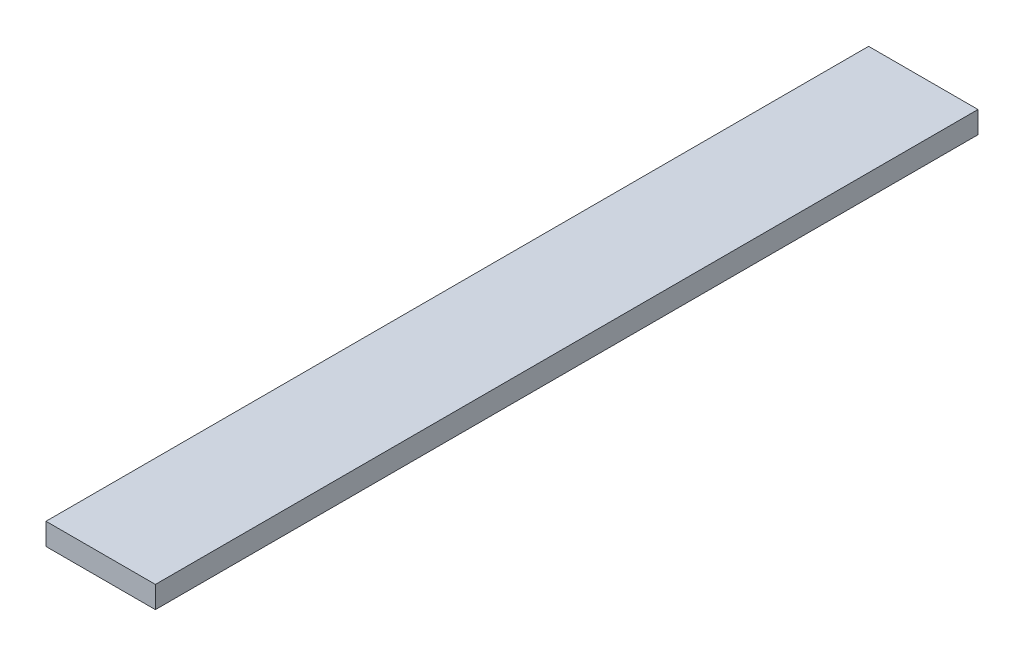
ISO-10303-21;
HEADER;
FILE_DESCRIPTION(('STEP AP214'),'2;1');
FILE_NAME('part.step','',(''),(''),'','','');
FILE_SCHEMA(('AUTOMOTIVE_DESIGN { 1 0 10303 214 1 1 1 1 }'));
ENDSEC;
DATA;
#1=APPLICATION_CONTEXT('core data for automotive mechanical design processes');
#2=APPLICATION_PROTOCOL_DEFINITION('international standard','automotive_design',2000,#1);
#3=PRODUCT_CONTEXT('',#1,'mechanical');
#4=PRODUCT('Part','Part','',(#3));
#5=PRODUCT_RELATED_PRODUCT_CATEGORY('part','',(#4));
#6=PRODUCT_DEFINITION_FORMATION('','',#4);
#7=PRODUCT_DEFINITION_CONTEXT('part definition',#1,'design');
#8=PRODUCT_DEFINITION('design','',#6,#7);
#9=PRODUCT_DEFINITION_SHAPE('','',#8);
#10=(LENGTH_UNIT() NAMED_UNIT(*) SI_UNIT(.MILLI.,.METRE.));
#11=(NAMED_UNIT(*) PLANE_ANGLE_UNIT() SI_UNIT($,.RADIAN.));
#12=(NAMED_UNIT(*) SI_UNIT($,.STERADIAN.) SOLID_ANGLE_UNIT());
#13=UNCERTAINTY_MEASURE_WITH_UNIT(LENGTH_MEASURE(1.E-05),#10,'distance_accuracy_value','');
#14=(GEOMETRIC_REPRESENTATION_CONTEXT(3) GLOBAL_UNCERTAINTY_ASSIGNED_CONTEXT((#13)) GLOBAL_UNIT_ASSIGNED_CONTEXT((#10,
#11,#12)) REPRESENTATION_CONTEXT('',''));
#15=CARTESIAN_POINT('',(0.,0.,0.));
#16=DIRECTION('',(0.,0.,1.));
#17=DIRECTION('',(1.,0.,0.));
#18=AXIS2_PLACEMENT_3D('',#15,#16,#17);
#19=CARTESIAN_POINT('',(0.,1.42999999999,0.));
#20=DIRECTION('',(0.,-1.,0.));
#21=DIRECTION('',(1.,0.,0.));
#22=AXIS2_PLACEMENT_3D('',#19,#20,#21);
#23=PLANE('',#22);
#24=DIRECTION('',(0.,0.,1.));
#25=VECTOR('',#24,1.);
#26=CARTESIAN_POINT('',(0.125,1.42999999999,0.195));
#27=LINE('',#26,#25);
#28=CARTESIAN_POINT('',(0.125,1.42999999999,0.195));
#29=VERTEX_POINT('',#28);
#30=CARTESIAN_POINT('',(0.125,1.42999999999,2.075));
#31=VERTEX_POINT('',#30);
#32=EDGE_CURVE('E80',#29,#31,#27,.T.);
#33=ORIENTED_EDGE('',*,*,#32,.T.);
#34=DIRECTION('',(-1.,0.,0.));
#35=VECTOR('',#34,1.);
#36=CARTESIAN_POINT('',(0.375,1.42999999999,2.075));
#37=LINE('',#36,#35);
#38=CARTESIAN_POINT('',(0.375,1.42999999999,2.075));
#39=VERTEX_POINT('',#38);
#40=EDGE_CURVE('E67',#31,#39,#37,.F.);
#41=ORIENTED_EDGE('',*,*,#40,.T.);
#42=DIRECTION('',(0.,0.,1.));
#43=VECTOR('',#42,1.);
#44=CARTESIAN_POINT('',(0.375,1.42999999999,0.195));
#45=LINE('',#44,#43);
#46=CARTESIAN_POINT('',(0.375,1.42999999999,0.195));
#47=VERTEX_POINT('',#46);
#48=EDGE_CURVE('E54',#39,#47,#45,.F.);
#49=ORIENTED_EDGE('',*,*,#48,.T.);
#50=DIRECTION('',(1.,0.,0.));
#51=VECTOR('',#50,1.);
#52=CARTESIAN_POINT('',(0.375,1.42999999999,0.195));
#53=LINE('',#52,#51);
#54=EDGE_CURVE('E19',#47,#29,#53,.F.);
#55=ORIENTED_EDGE('',*,*,#54,.T.);
#56=EDGE_LOOP('',(#33,#41,#49,#55));
#57=FACE_BOUND('',#56,.T.);
#58=ADVANCED_FACE('F16',(#57),#23,.F.);
#59=CARTESIAN_POINT('',(0.375,1.37999999999,0.195));
#60=DIRECTION('',(0.,0.,1.));
#61=DIRECTION('',(1.,0.,0.));
#62=AXIS2_PLACEMENT_3D('',#59,#60,#61);
#63=PLANE('',#62);
#64=DIRECTION('',(0.,-1.,0.));
#65=VECTOR('',#64,1.);
#66=CARTESIAN_POINT('',(0.375,1.37999999999,0.195));
#67=LINE('',#66,#65);
#68=CARTESIAN_POINT('',(0.375,1.37999999999,0.195));
#69=VERTEX_POINT('',#68);
#70=EDGE_CURVE('E60',#47,#69,#67,.T.);
#71=ORIENTED_EDGE('',*,*,#70,.T.);
#72=DIRECTION('',(1.,0.,0.));
#73=VECTOR('',#72,1.);
#74=CARTESIAN_POINT('',(0.,1.37999999999,0.195));
#75=LINE('',#74,#73);
#76=CARTESIAN_POINT('',(0.125,1.37999999999,0.195));
#77=VERTEX_POINT('',#76);
#78=EDGE_CURVE('E82',#77,#69,#75,.T.);
#79=ORIENTED_EDGE('',*,*,#78,.F.);
#80=DIRECTION('',(0.,1.,0.));
#81=VECTOR('',#80,1.);
#82=CARTESIAN_POINT('',(0.125,1.37999999999,0.195));
#83=LINE('',#82,#81);
#84=EDGE_CURVE('E63',#77,#29,#83,.T.);
#85=ORIENTED_EDGE('',*,*,#84,.T.);
#86=ORIENTED_EDGE('',*,*,#54,.F.);
#87=EDGE_LOOP('',(#71,#79,#85,#86));
#88=FACE_BOUND('',#87,.T.);
#89=ADVANCED_FACE('F59',(#88),#63,.F.);
#90=CARTESIAN_POINT('',(0.375,1.37999999999,0.195));
#91=DIRECTION('',(-1.,0.,0.));
#92=DIRECTION('',(0.,-1.,0.));
#93=AXIS2_PLACEMENT_3D('',#90,#91,#92);
#94=PLANE('',#93);
#95=DIRECTION('',(0.,1.,0.));
#96=VECTOR('',#95,1.);
#97=CARTESIAN_POINT('',(0.375,1.37999999999,2.075));
#98=LINE('',#97,#96);
#99=CARTESIAN_POINT('',(0.375,1.37999999999,2.075));
#100=VERTEX_POINT('',#99);
#101=EDGE_CURVE('E69',#39,#100,#98,.F.);
#102=ORIENTED_EDGE('',*,*,#101,.T.);
#103=DIRECTION('',(0.,0.,1.));
#104=VECTOR('',#103,1.);
#105=CARTESIAN_POINT('',(0.375,1.37999999999,0.));
#106=LINE('',#105,#104);
#107=EDGE_CURVE('E73',#69,#100,#106,.T.);
#108=ORIENTED_EDGE('',*,*,#107,.F.);
#109=ORIENTED_EDGE('',*,*,#70,.F.);
#110=ORIENTED_EDGE('',*,*,#48,.F.);
#111=EDGE_LOOP('',(#102,#108,#109,#110));
#112=FACE_BOUND('',#111,.T.);
#113=ADVANCED_FACE('F71',(#112),#94,.F.);
#114=CARTESIAN_POINT('',(0.375,1.37999999999,2.075));
#115=DIRECTION('',(0.,0.,-1.));
#116=DIRECTION('',(-1.,0.,0.));
#117=AXIS2_PLACEMENT_3D('',#114,#115,#116);
#118=PLANE('',#117);
#119=DIRECTION('',(0.,1.,0.));
#120=VECTOR('',#119,1.);
#121=CARTESIAN_POINT('',(0.125,1.37999999999,2.075));
#122=LINE('',#121,#120);
#123=CARTESIAN_POINT('',(0.125,1.37999999999,2.075));
#124=VERTEX_POINT('',#123);
#125=EDGE_CURVE('E34',#31,#124,#122,.F.);
#126=ORIENTED_EDGE('',*,*,#125,.T.);
#127=DIRECTION('',(1.,0.,0.));
#128=VECTOR('',#127,1.);
#129=CARTESIAN_POINT('',(0.,1.37999999999,2.075));
#130=LINE('',#129,#128);
#131=EDGE_CURVE('E25',#100,#124,#130,.F.);
#132=ORIENTED_EDGE('',*,*,#131,.F.);
#133=ORIENTED_EDGE('',*,*,#101,.F.);
#134=ORIENTED_EDGE('',*,*,#40,.F.);
#135=EDGE_LOOP('',(#126,#132,#133,#134));
#136=FACE_BOUND('',#135,.T.);
#137=ADVANCED_FACE('F88',(#136),#118,.F.);
#138=CARTESIAN_POINT('',(0.125,1.37999999999,0.195));
#139=DIRECTION('',(1.,0.,0.));
#140=DIRECTION('',(0.,1.,0.));
#141=AXIS2_PLACEMENT_3D('',#138,#139,#140);
#142=PLANE('',#141);
#143=ORIENTED_EDGE('',*,*,#84,.F.);
#144=DIRECTION('',(0.,0.,1.));
#145=VECTOR('',#144,1.);
#146=CARTESIAN_POINT('',(0.125,1.37999999999,0.));
#147=LINE('',#146,#145);
#148=EDGE_CURVE('E11',#124,#77,#147,.F.);
#149=ORIENTED_EDGE('',*,*,#148,.F.);
#150=ORIENTED_EDGE('',*,*,#125,.F.);
#151=ORIENTED_EDGE('',*,*,#32,.F.);
#152=EDGE_LOOP('',(#143,#149,#150,#151));
#153=FACE_BOUND('',#152,.T.);
#154=ADVANCED_FACE('F90',(#153),#142,.F.);
#155=CARTESIAN_POINT('',(0.,1.37999999999,0.));
#156=DIRECTION('',(0.,-1.,0.));
#157=DIRECTION('',(1.,0.,0.));
#158=AXIS2_PLACEMENT_3D('',#155,#156,#157);
#159=PLANE('',#158);
#160=ORIENTED_EDGE('',*,*,#131,.T.);
#161=ORIENTED_EDGE('',*,*,#148,.T.);
#162=ORIENTED_EDGE('',*,*,#78,.T.);
#163=ORIENTED_EDGE('',*,*,#107,.T.);
#164=EDGE_LOOP('',(#160,#161,#162,#163));
#165=FACE_BOUND('',#164,.T.);
#166=ADVANCED_FACE('F87',(#165),#159,.T.);
#167=CLOSED_SHELL('',(#58,#89,#113,#137,#154,#166));
#168=MANIFOLD_SOLID_BREP('B1',#167);
#169=ADVANCED_BREP_SHAPE_REPRESENTATION('',(#18,#168),#14);
#170=SHAPE_DEFINITION_REPRESENTATION(#9,#169);
ENDSEC;
END-ISO-10303-21;
